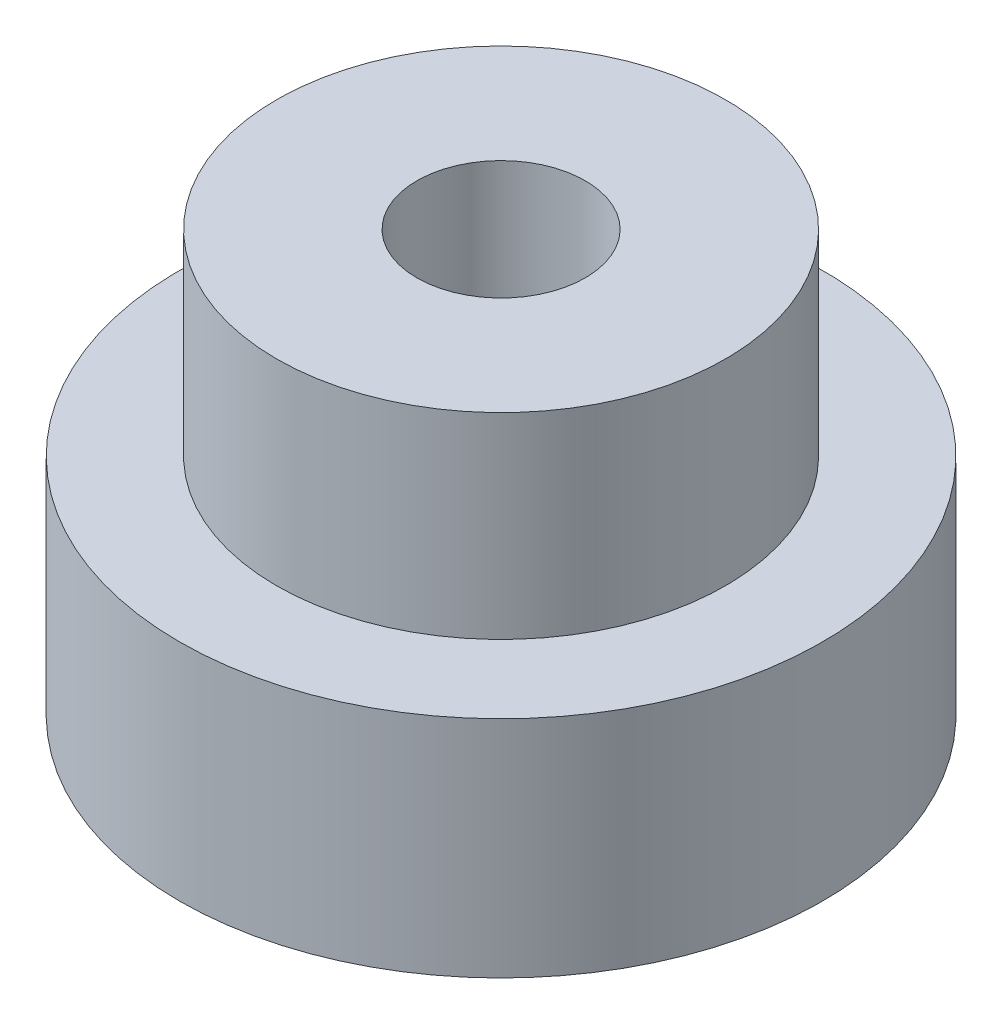
ISO-10303-21;
HEADER;
FILE_DESCRIPTION(('STEP AP214'),'2;1');
FILE_NAME('part.step','',(''),(''),'','','');
FILE_SCHEMA(('AUTOMOTIVE_DESIGN { 1 0 10303 214 1 1 1 1 }'));
ENDSEC;
DATA;
#1=APPLICATION_CONTEXT('core data for automotive mechanical design processes');
#2=APPLICATION_PROTOCOL_DEFINITION('international standard','automotive_design',2000,#1);
#3=PRODUCT_CONTEXT('',#1,'mechanical');
#4=PRODUCT('Part','Part','',(#3));
#5=PRODUCT_RELATED_PRODUCT_CATEGORY('part','',(#4));
#6=PRODUCT_DEFINITION_FORMATION('','',#4);
#7=PRODUCT_DEFINITION_CONTEXT('part definition',#1,'design');
#8=PRODUCT_DEFINITION('design','',#6,#7);
#9=PRODUCT_DEFINITION_SHAPE('','',#8);
#10=(LENGTH_UNIT() NAMED_UNIT(*) SI_UNIT(.MILLI.,.METRE.));
#11=(NAMED_UNIT(*) PLANE_ANGLE_UNIT() SI_UNIT($,.RADIAN.));
#12=(NAMED_UNIT(*) SI_UNIT($,.STERADIAN.) SOLID_ANGLE_UNIT());
#13=UNCERTAINTY_MEASURE_WITH_UNIT(LENGTH_MEASURE(1.E-05),#10,'distance_accuracy_value','');
#14=(GEOMETRIC_REPRESENTATION_CONTEXT(3) GLOBAL_UNCERTAINTY_ASSIGNED_CONTEXT((#13)) GLOBAL_UNIT_ASSIGNED_CONTEXT((#10,
#11,#12)) REPRESENTATION_CONTEXT('',''));
#15=CARTESIAN_POINT('',(0.,0.,0.));
#16=DIRECTION('',(0.,0.,1.));
#17=DIRECTION('',(1.,0.,0.));
#18=AXIS2_PLACEMENT_3D('',#15,#16,#17);
#19=CARTESIAN_POINT('',(0.,15.,0.));
#20=DIRECTION('',(0.,1.,0.));
#21=DIRECTION('',(0.,0.,1.));
#22=AXIS2_PLACEMENT_3D('',#19,#20,#21);
#23=PLANE('',#22);
#24=CARTESIAN_POINT('',(0.,15.,0.));
#25=DIRECTION('',(0.,1.,0.));
#26=DIRECTION('',(0.,0.,1.));
#27=AXIS2_PLACEMENT_3D('',#24,#25,#26);
#28=CIRCLE('',#27,8.);
#29=CARTESIAN_POINT('',(0.,15.,8.));
#30=VERTEX_POINT('',#29);
#31=EDGE_CURVE('E12',#30,#30,#28,.T.);
#32=ORIENTED_EDGE('',*,*,#31,.T.);
#33=EDGE_LOOP('',(#32));
#34=FACE_BOUND('',#33,.T.);
#35=CARTESIAN_POINT('',(0.,15.,0.));
#36=DIRECTION('',(0.,1.,0.));
#37=DIRECTION('',(0.,0.,1.));
#38=AXIS2_PLACEMENT_3D('',#35,#36,#37);
#39=CIRCLE('',#38,3.);
#40=CARTESIAN_POINT('',(0.,15.,3.));
#41=VERTEX_POINT('',#40);
#42=EDGE_CURVE('E61',#41,#41,#39,.T.);
#43=ORIENTED_EDGE('',*,*,#42,.F.);
#44=EDGE_LOOP('',(#43));
#45=FACE_BOUND('',#44,.T.);
#46=ADVANCED_FACE('F50',(#34,#45),#23,.T.);
#47=CARTESIAN_POINT('',(0.,8.,0.));
#48=DIRECTION('',(0.,1.,0.));
#49=DIRECTION('',(0.,0.,1.));
#50=AXIS2_PLACEMENT_3D('',#47,#48,#49);
#51=PLANE('',#50);
#52=CARTESIAN_POINT('',(0.,8.,0.));
#53=DIRECTION('',(0.,1.,0.));
#54=DIRECTION('',(0.,0.,1.));
#55=AXIS2_PLACEMENT_3D('',#52,#53,#54);
#56=CIRCLE('',#55,8.);
#57=CARTESIAN_POINT('',(0.,8.,8.));
#58=VERTEX_POINT('',#57);
#59=EDGE_CURVE('E54',#58,#58,#56,.T.);
#60=ORIENTED_EDGE('',*,*,#59,.F.);
#61=EDGE_LOOP('',(#60));
#62=FACE_BOUND('',#61,.T.);
#63=CARTESIAN_POINT('',(0.,8.,0.));
#64=DIRECTION('',(0.,1.,0.));
#65=DIRECTION('',(0.,0.,1.));
#66=AXIS2_PLACEMENT_3D('',#63,#64,#65);
#67=CIRCLE('',#66,3.);
#68=CARTESIAN_POINT('',(0.,8.,3.));
#69=VERTEX_POINT('',#68);
#70=EDGE_CURVE('E63',#69,#69,#67,.T.);
#71=ORIENTED_EDGE('',*,*,#70,.T.);
#72=EDGE_LOOP('',(#71));
#73=FACE_BOUND('',#72,.T.);
#74=ADVANCED_FACE('F73',(#62,#73),#51,.F.);
#75=CARTESIAN_POINT('',(0.,15.,0.));
#76=DIRECTION('',(0.,-1.,0.));
#77=DIRECTION('',(0.,0.,-1.));
#78=AXIS2_PLACEMENT_3D('',#75,#76,#77);
#79=CYLINDRICAL_SURFACE('',#78,8.);
#80=ORIENTED_EDGE('',*,*,#31,.F.);
#81=EDGE_LOOP('',(#80));
#82=FACE_BOUND('',#81,.T.);
#83=ORIENTED_EDGE('',*,*,#59,.T.);
#84=EDGE_LOOP('',(#83));
#85=FACE_BOUND('',#84,.T.);
#86=ADVANCED_FACE('F52',(#82,#85),#79,.T.);
#87=CARTESIAN_POINT('',(0.,15.,0.));
#88=DIRECTION('',(0.,-1.,0.));
#89=DIRECTION('',(0.,0.,-1.));
#90=AXIS2_PLACEMENT_3D('',#87,#88,#89);
#91=CYLINDRICAL_SURFACE('',#90,3.);
#92=ORIENTED_EDGE('',*,*,#42,.T.);
#93=EDGE_LOOP('',(#92));
#94=FACE_BOUND('',#93,.T.);
#95=ORIENTED_EDGE('',*,*,#70,.F.);
#96=EDGE_LOOP('',(#95));
#97=FACE_BOUND('',#96,.T.);
#98=ADVANCED_FACE('F69',(#94,#97),#91,.F.);
#99=CLOSED_SHELL('',(#46,#74,#86,#98));
#100=MANIFOLD_SOLID_BREP('B2',#99);
#101=CARTESIAN_POINT('',(0.,8.,0.));
#102=DIRECTION('',(0.,-1.,0.));
#103=DIRECTION('',(0.,0.,-1.));
#104=AXIS2_PLACEMENT_3D('',#101,#102,#103);
#105=CYLINDRICAL_SURFACE('',#104,8.);
#106=CARTESIAN_POINT('',(0.,8.,0.));
#107=DIRECTION('',(0.,1.,0.));
#108=DIRECTION('',(0.,0.,1.));
#109=AXIS2_PLACEMENT_3D('',#106,#107,#108);
#110=CIRCLE('',#109,8.);
#111=CARTESIAN_POINT('',(0.,8.,8.));
#112=VERTEX_POINT('',#111);
#113=EDGE_CURVE('E118',#112,#112,#110,.T.);
#114=ORIENTED_EDGE('',*,*,#113,.T.);
#115=EDGE_LOOP('',(#114));
#116=FACE_BOUND('',#115,.T.);
#117=CARTESIAN_POINT('',(0.,0.,0.));
#118=DIRECTION('',(0.,1.,0.));
#119=DIRECTION('',(0.,0.,1.));
#120=AXIS2_PLACEMENT_3D('',#117,#118,#119);
#121=CIRCLE('',#120,8.);
#122=CARTESIAN_POINT('',(0.,0.,8.));
#123=VERTEX_POINT('',#122);
#124=EDGE_CURVE('E124',#123,#123,#121,.T.);
#125=ORIENTED_EDGE('',*,*,#124,.F.);
#126=EDGE_LOOP('',(#125));
#127=FACE_BOUND('',#126,.T.);
#128=ADVANCED_FACE('F111',(#116,#127),#105,.F.);
#129=CARTESIAN_POINT('',(0.,8.,0.));
#130=DIRECTION('',(0.,-1.,0.));
#131=DIRECTION('',(0.,0.,-1.));
#132=AXIS2_PLACEMENT_3D('',#129,#130,#131);
#133=CYLINDRICAL_SURFACE('',#132,11.46);
#134=CARTESIAN_POINT('',(0.,8.,0.));
#135=DIRECTION('',(0.,1.,0.));
#136=DIRECTION('',(0.,0.,1.));
#137=AXIS2_PLACEMENT_3D('',#134,#135,#136);
#138=CIRCLE('',#137,11.46);
#139=CARTESIAN_POINT('',(0.,8.,11.46));
#140=VERTEX_POINT('',#139);
#141=EDGE_CURVE('E49',#140,#140,#138,.T.);
#142=ORIENTED_EDGE('',*,*,#141,.F.);
#143=EDGE_LOOP('',(#142));
#144=FACE_BOUND('',#143,.T.);
#145=CARTESIAN_POINT('',(0.,0.,0.));
#146=DIRECTION('',(0.,1.,0.));
#147=DIRECTION('',(0.,0.,1.));
#148=AXIS2_PLACEMENT_3D('',#145,#146,#147);
#149=CIRCLE('',#148,11.46);
#150=CARTESIAN_POINT('',(0.,0.,11.46));
#151=VERTEX_POINT('',#150);
#152=EDGE_CURVE('E114',#151,#151,#149,.T.);
#153=ORIENTED_EDGE('',*,*,#152,.T.);
#154=EDGE_LOOP('',(#153));
#155=FACE_BOUND('',#154,.T.);
#156=ADVANCED_FACE('F131',(#144,#155),#133,.T.);
#157=CARTESIAN_POINT('',(0.,8.,0.));
#158=DIRECTION('',(0.,1.,0.));
#159=DIRECTION('',(0.,0.,1.));
#160=AXIS2_PLACEMENT_3D('',#157,#158,#159);
#161=PLANE('',#160);
#162=ORIENTED_EDGE('',*,*,#113,.F.);
#163=EDGE_LOOP('',(#162));
#164=FACE_BOUND('',#163,.T.);
#165=ORIENTED_EDGE('',*,*,#141,.T.);
#166=EDGE_LOOP('',(#165));
#167=FACE_BOUND('',#166,.T.);
#168=ADVANCED_FACE('F135',(#164,#167),#161,.T.);
#169=CARTESIAN_POINT('',(0.,0.,0.));
#170=DIRECTION('',(0.,1.,0.));
#171=DIRECTION('',(0.,0.,1.));
#172=AXIS2_PLACEMENT_3D('',#169,#170,#171);
#173=PLANE('',#172);
#174=ORIENTED_EDGE('',*,*,#124,.T.);
#175=EDGE_LOOP('',(#174));
#176=FACE_BOUND('',#175,.T.);
#177=ORIENTED_EDGE('',*,*,#152,.F.);
#178=EDGE_LOOP('',(#177));
#179=FACE_BOUND('',#178,.T.);
#180=ADVANCED_FACE('F133',(#176,#179),#173,.F.);
#181=CLOSED_SHELL('',(#128,#156,#168,#180));
#182=MANIFOLD_SOLID_BREP('B7',#181);
#183=ADVANCED_BREP_SHAPE_REPRESENTATION('',(#18,#100,#182),#14);
#184=SHAPE_DEFINITION_REPRESENTATION(#9,#183);
ENDSEC;
END-ISO-10303-21;
